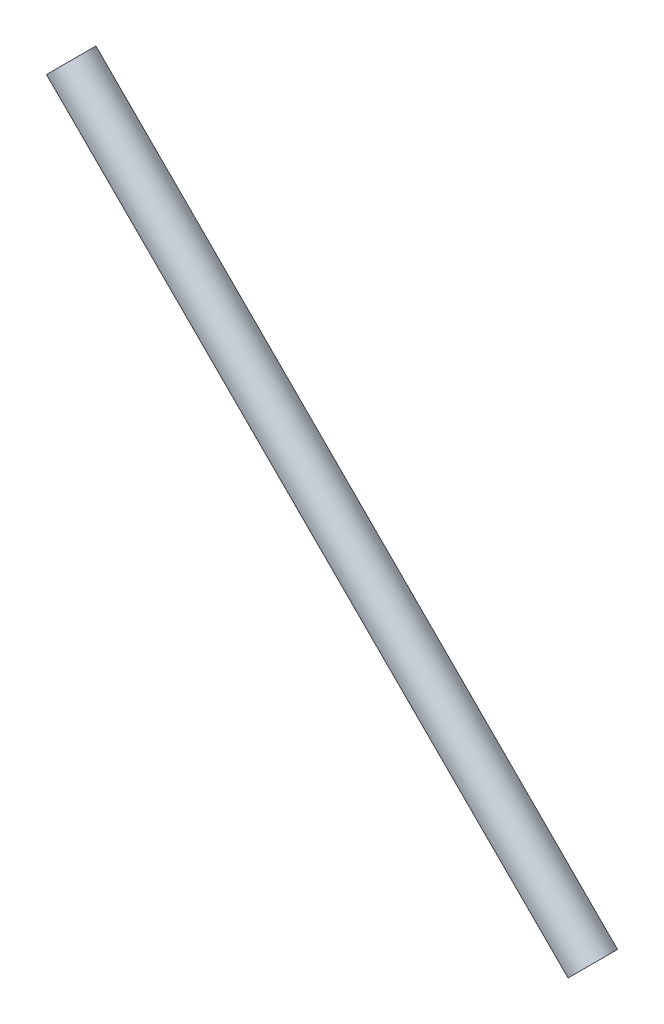
ISO-10303-21;
HEADER;
FILE_DESCRIPTION(('STEP AP214'),'2;1');
FILE_NAME('part.step','',(''),(''),'','','');
FILE_SCHEMA(('AUTOMOTIVE_DESIGN { 1 0 10303 214 1 1 1 1 }'));
ENDSEC;
DATA;
#1=APPLICATION_CONTEXT('core data for automotive mechanical design processes');
#2=APPLICATION_PROTOCOL_DEFINITION('international standard','automotive_design',2000,#1);
#3=PRODUCT_CONTEXT('',#1,'mechanical');
#4=PRODUCT('Part','Part','',(#3));
#5=PRODUCT_RELATED_PRODUCT_CATEGORY('part','',(#4));
#6=PRODUCT_DEFINITION_FORMATION('','',#4);
#7=PRODUCT_DEFINITION_CONTEXT('part definition',#1,'design');
#8=PRODUCT_DEFINITION('design','',#6,#7);
#9=PRODUCT_DEFINITION_SHAPE('','',#8);
#10=(LENGTH_UNIT() NAMED_UNIT(*) SI_UNIT(.MILLI.,.METRE.));
#11=(NAMED_UNIT(*) PLANE_ANGLE_UNIT() SI_UNIT($,.RADIAN.));
#12=(NAMED_UNIT(*) SI_UNIT($,.STERADIAN.) SOLID_ANGLE_UNIT());
#13=UNCERTAINTY_MEASURE_WITH_UNIT(LENGTH_MEASURE(1.E-05),#10,'distance_accuracy_value','');
#14=(GEOMETRIC_REPRESENTATION_CONTEXT(3) GLOBAL_UNCERTAINTY_ASSIGNED_CONTEXT((#13)) GLOBAL_UNIT_ASSIGNED_CONTEXT((#10,
#11,#12)) REPRESENTATION_CONTEXT('',''));
#15=CARTESIAN_POINT('',(0.,0.,0.));
#16=DIRECTION('',(0.,0.,1.));
#17=DIRECTION('',(1.,0.,0.));
#18=AXIS2_PLACEMENT_3D('',#15,#16,#17);
#19=CARTESIAN_POINT('',(-1537.67869389959,1626.34559672907,-27.5663130260426));
#20=DIRECTION('',(0.707106781186544,-0.707106781186551,0.));
#21=DIRECTION('',(0.707106781186551,0.707106781186544,0.));
#22=AXIS2_PLACEMENT_3D('',#19,#20,#21);
#23=CYLINDRICAL_SURFACE('',#22,63.);
#24=CARTESIAN_POINT('',(-1537.67869389959,1626.34559672907,-27.5663130260426));
#25=DIRECTION('',(0.707106781186544,-0.707106781186551,0.));
#26=DIRECTION('',(0.707106781186551,0.707106781186544,0.));
#27=AXIS2_PLACEMENT_3D('',#24,#25,#26);
#28=CIRCLE('',#27,63.);
#29=CARTESIAN_POINT('',(-1493.13096668484,1670.89332394382,-27.5663130260426));
#30=VERTEX_POINT('',#29);
#31=EDGE_CURVE('E10',#30,#30,#28,.T.);
#32=ORIENTED_EDGE('',*,*,#31,.T.);
#33=EDGE_LOOP('',(#32));
#34=FACE_BOUND('',#33,.T.);
#35=CARTESIAN_POINT('',(88.6669028294591,0.,-27.5663130260426));
#36=DIRECTION('',(0.707106781186544,-0.707106781186551,0.));
#37=DIRECTION('',(0.707106781186551,0.707106781186544,0.));
#38=AXIS2_PLACEMENT_3D('',#35,#36,#37);
#39=CIRCLE('',#38,63.);
#40=CARTESIAN_POINT('',(133.214630044212,44.5477272147522,-27.5663130260426));
#41=VERTEX_POINT('',#40);
#42=EDGE_CURVE('E46',#41,#41,#39,.T.);
#43=ORIENTED_EDGE('',*,*,#42,.F.);
#44=EDGE_LOOP('',(#43));
#45=FACE_BOUND('',#44,.T.);
#46=ADVANCED_FACE('F43',(#34,#45),#23,.T.);
#47=CARTESIAN_POINT('',(-1537.67869389959,1626.34559672907,-27.5663130260426));
#48=DIRECTION('',(0.707106781186544,-0.707106781186551,0.));
#49=DIRECTION('',(0.707106781186551,0.707106781186544,0.));
#50=AXIS2_PLACEMENT_3D('',#47,#48,#49);
#51=PLANE('',#50);
#52=CARTESIAN_POINT('',(-1537.67869389959,1626.34559672907,-27.5663130260426));
#53=DIRECTION('',(0.707106781186544,-0.707106781186551,0.));
#54=DIRECTION('',(0.707106781186551,0.707106781186544,0.));
#55=AXIS2_PLACEMENT_3D('',#52,#53,#54);
#56=CIRCLE('',#55,60.);
#57=CARTESIAN_POINT('',(-1495.2522870284,1668.77200360026,-27.5663130260426));
#58=VERTEX_POINT('',#57);
#59=EDGE_CURVE('E55',#58,#58,#56,.T.);
#60=ORIENTED_EDGE('',*,*,#59,.T.);
#61=EDGE_LOOP('',(#60));
#62=FACE_BOUND('',#61,.T.);
#63=ORIENTED_EDGE('',*,*,#31,.F.);
#64=EDGE_LOOP('',(#63));
#65=FACE_BOUND('',#64,.T.);
#66=ADVANCED_FACE('F65',(#62,#65),#51,.F.);
#67=CARTESIAN_POINT('',(88.6669028294591,0.,-27.5663130260426));
#68=DIRECTION('',(0.707106781186544,-0.707106781186551,0.));
#69=DIRECTION('',(0.707106781186551,0.707106781186544,0.));
#70=AXIS2_PLACEMENT_3D('',#67,#68,#69);
#71=PLANE('',#70);
#72=CARTESIAN_POINT('',(88.6669028294591,0.,-27.5663130260426));
#73=DIRECTION('',(0.707106781186544,-0.707106781186551,0.));
#74=DIRECTION('',(0.707106781186551,0.707106781186544,0.));
#75=AXIS2_PLACEMENT_3D('',#72,#73,#74);
#76=CIRCLE('',#75,60.);
#77=CARTESIAN_POINT('',(131.093309700652,42.4264068711926,-27.5663130260426));
#78=VERTEX_POINT('',#77);
#79=EDGE_CURVE('E57',#78,#78,#76,.T.);
#80=ORIENTED_EDGE('',*,*,#79,.F.);
#81=EDGE_LOOP('',(#80));
#82=FACE_BOUND('',#81,.T.);
#83=ORIENTED_EDGE('',*,*,#42,.T.);
#84=EDGE_LOOP('',(#83));
#85=FACE_BOUND('',#84,.T.);
#86=ADVANCED_FACE('F71',(#82,#85),#71,.T.);
#87=CARTESIAN_POINT('',(-1537.67869389959,1626.34559672907,-27.5663130260426));
#88=DIRECTION('',(0.707106781186544,-0.707106781186551,0.));
#89=DIRECTION('',(0.707106781186551,0.707106781186544,0.));
#90=AXIS2_PLACEMENT_3D('',#87,#88,#89);
#91=CYLINDRICAL_SURFACE('',#90,60.);
#92=ORIENTED_EDGE('',*,*,#59,.F.);
#93=EDGE_LOOP('',(#92));
#94=FACE_BOUND('',#93,.T.);
#95=ORIENTED_EDGE('',*,*,#79,.T.);
#96=EDGE_LOOP('',(#95));
#97=FACE_BOUND('',#96,.T.);
#98=ADVANCED_FACE('F68',(#94,#97),#91,.F.);
#99=CLOSED_SHELL('',(#46,#66,#86,#98));
#100=MANIFOLD_SOLID_BREP('B2',#99);
#101=ADVANCED_BREP_SHAPE_REPRESENTATION('',(#18,#100),#14);
#102=SHAPE_DEFINITION_REPRESENTATION(#9,#101);
ENDSEC;
END-ISO-10303-21;
